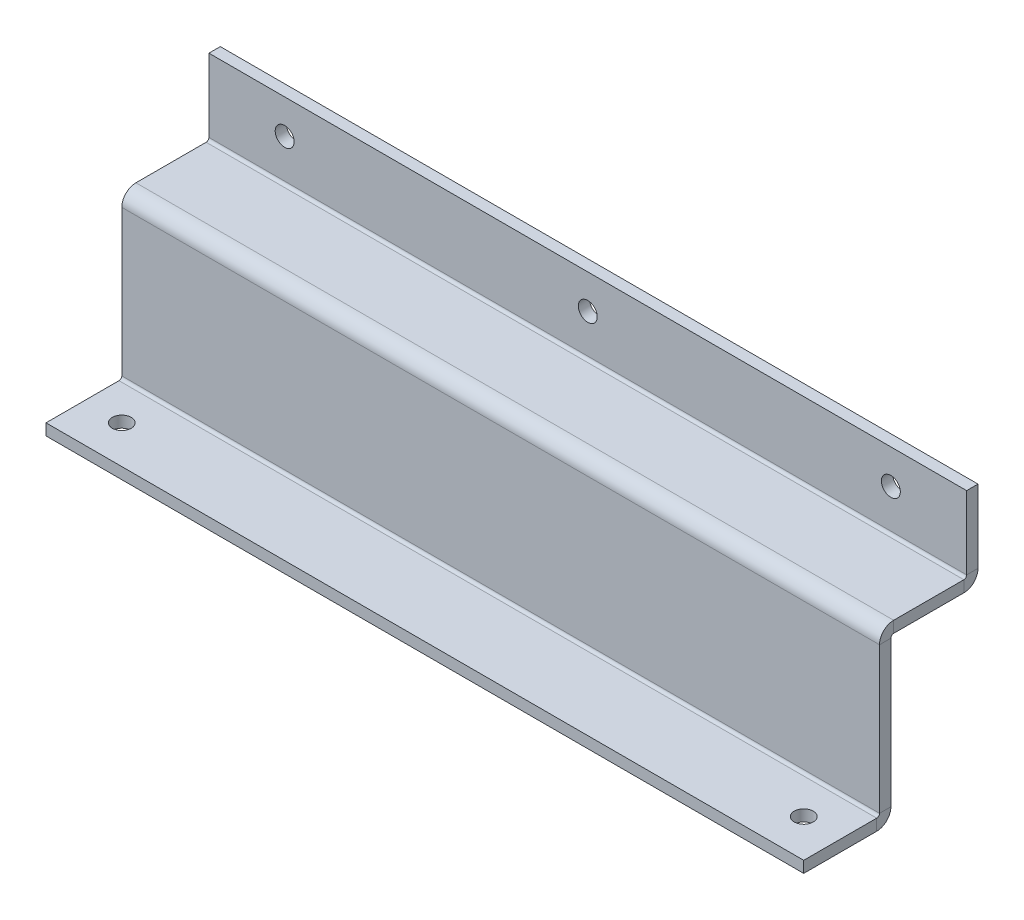
ISO-10303-21;
HEADER;
FILE_DESCRIPTION(('STEP AP214'),'2;1');
FILE_NAME('part.step','',(''),(''),'','','');
FILE_SCHEMA(('AUTOMOTIVE_DESIGN { 1 0 10303 214 1 1 1 1 }'));
ENDSEC;
DATA;
#1=APPLICATION_CONTEXT('core data for automotive mechanical design processes');
#2=APPLICATION_PROTOCOL_DEFINITION('international standard','automotive_design',2000,#1);
#3=PRODUCT_CONTEXT('',#1,'mechanical');
#4=PRODUCT('Part','Part','',(#3));
#5=PRODUCT_RELATED_PRODUCT_CATEGORY('part','',(#4));
#6=PRODUCT_DEFINITION_FORMATION('','',#4);
#7=PRODUCT_DEFINITION_CONTEXT('part definition',#1,'design');
#8=PRODUCT_DEFINITION('design','',#6,#7);
#9=PRODUCT_DEFINITION_SHAPE('','',#8);
#10=(LENGTH_UNIT() NAMED_UNIT(*) SI_UNIT(.MILLI.,.METRE.));
#11=(NAMED_UNIT(*) PLANE_ANGLE_UNIT() SI_UNIT($,.RADIAN.));
#12=(NAMED_UNIT(*) SI_UNIT($,.STERADIAN.) SOLID_ANGLE_UNIT());
#13=UNCERTAINTY_MEASURE_WITH_UNIT(LENGTH_MEASURE(1.E-05),#10,'distance_accuracy_value','');
#14=(GEOMETRIC_REPRESENTATION_CONTEXT(3) GLOBAL_UNCERTAINTY_ASSIGNED_CONTEXT((#13)) GLOBAL_UNIT_ASSIGNED_CONTEXT((#10,
#11,#12)) REPRESENTATION_CONTEXT('',''));
#15=CARTESIAN_POINT('',(0.,0.,0.));
#16=DIRECTION('',(0.,0.,1.));
#17=DIRECTION('',(1.,0.,0.));
#18=AXIS2_PLACEMENT_3D('',#15,#16,#17);
#19=CARTESIAN_POINT('',(-100.,43.0000000000001,-33.));
#20=DIRECTION('',(-1.,0.,0.));
#21=DIRECTION('',(0.,0.,1.));
#22=AXIS2_PLACEMENT_3D('',#19,#20,#21);
#23=PLANE('',#22);
#24=DIRECTION('',(0.,0.,-1.));
#25=VECTOR('',#24,1.);
#26=CARTESIAN_POINT('',(-100.,43.0000000000001,-33.));
#27=LINE('',#26,#25);
#28=CARTESIAN_POINT('',(-100.,43.,-13.7366));
#29=VERTEX_POINT('',#28);
#30=CARTESIAN_POINT('',(-100.,43.0000000000001,-32.2634));
#31=VERTEX_POINT('',#30);
#32=EDGE_CURVE('E213',#29,#31,#27,.T.);
#33=ORIENTED_EDGE('',*,*,#32,.T.);
#34=DIRECTION('',(0.,-1.,0.));
#35=VECTOR('',#34,1.);
#36=CARTESIAN_POINT('',(-100.,43.0000000000001,-32.2634));
#37=LINE('',#36,#35);
#38=CARTESIAN_POINT('',(-100.,40.0000000000001,-32.2634));
#39=VERTEX_POINT('',#38);
#40=EDGE_CURVE('E189',#31,#39,#37,.T.);
#41=ORIENTED_EDGE('',*,*,#40,.T.);
#42=DIRECTION('',(0.,0.,-1.));
#43=VECTOR('',#42,1.);
#44=CARTESIAN_POINT('',(-100.,40.0000000000001,-33.));
#45=LINE('',#44,#43);
#46=CARTESIAN_POINT('',(-100.,40.,-13.7366));
#47=VERTEX_POINT('',#46);
#48=EDGE_CURVE('E212',#47,#39,#45,.T.);
#49=ORIENTED_EDGE('',*,*,#48,.F.);
#50=DIRECTION('',(0.,1.,0.));
#51=VECTOR('',#50,1.);
#52=CARTESIAN_POINT('',(-100.,40.,-13.7366));
#53=LINE('',#52,#51);
#54=EDGE_CURVE('E199',#47,#29,#53,.T.);
#55=ORIENTED_EDGE('',*,*,#54,.T.);
#56=EDGE_LOOP('',(#33,#41,#49,#55));
#57=FACE_BOUND('',#56,.T.);
#58=ADVANCED_FACE('F32',(#57),#23,.T.);
#59=CARTESIAN_POINT('',(100.,43.,-13.));
#60=DIRECTION('',(0.,1.,0.));
#61=DIRECTION('',(0.,0.,1.));
#62=AXIS2_PLACEMENT_3D('',#59,#60,#61);
#63=PLANE('',#62);
#64=DIRECTION('',(0.,0.,1.));
#65=VECTOR('',#64,1.);
#66=CARTESIAN_POINT('',(100.,43.,-13.));
#67=LINE('',#66,#65);
#68=CARTESIAN_POINT('',(100.,43.0000000000001,-32.2634));
#69=VERTEX_POINT('',#68);
#70=CARTESIAN_POINT('',(100.,43.,-13.7366));
#71=VERTEX_POINT('',#70);
#72=EDGE_CURVE('E215',#69,#71,#67,.T.);
#73=ORIENTED_EDGE('',*,*,#72,.F.);
#74=DIRECTION('',(-1.,0.,0.));
#75=VECTOR('',#74,1.);
#76=CARTESIAN_POINT('',(-100.,43.0000000000001,-32.2634));
#77=LINE('',#76,#75);
#78=EDGE_CURVE('E54',#31,#69,#77,.F.);
#79=ORIENTED_EDGE('',*,*,#78,.F.);
#80=ORIENTED_EDGE('',*,*,#32,.F.);
#81=DIRECTION('',(1.,0.,0.));
#82=VECTOR('',#81,1.);
#83=CARTESIAN_POINT('',(100.,43.,-13.7366));
#84=LINE('',#83,#82);
#85=EDGE_CURVE('E207',#29,#71,#84,.T.);
#86=ORIENTED_EDGE('',*,*,#85,.T.);
#87=EDGE_LOOP('',(#73,#79,#80,#86));
#88=FACE_BOUND('',#87,.T.);
#89=ADVANCED_FACE('F336',(#88),#63,.T.);
#90=CARTESIAN_POINT('',(100.,40.,-13.));
#91=DIRECTION('',(0.,1.,0.));
#92=DIRECTION('',(0.,0.,1.));
#93=AXIS2_PLACEMENT_3D('',#90,#91,#92);
#94=PLANE('',#93);
#95=DIRECTION('',(-1.,0.,0.));
#96=VECTOR('',#95,1.);
#97=CARTESIAN_POINT('',(-100.,40.0000000000001,-32.2634));
#98=LINE('',#97,#96);
#99=CARTESIAN_POINT('',(100.,40.0000000000001,-32.2634));
#100=VERTEX_POINT('',#99);
#101=EDGE_CURVE('E183',#39,#100,#98,.F.);
#102=ORIENTED_EDGE('',*,*,#101,.T.);
#103=DIRECTION('',(0.,0.,1.));
#104=VECTOR('',#103,1.);
#105=CARTESIAN_POINT('',(100.,40.,-13.));
#106=LINE('',#105,#104);
#107=CARTESIAN_POINT('',(100.,40.,-13.7366));
#108=VERTEX_POINT('',#107);
#109=EDGE_CURVE('E216',#100,#108,#106,.T.);
#110=ORIENTED_EDGE('',*,*,#109,.T.);
#111=DIRECTION('',(1.,0.,0.));
#112=VECTOR('',#111,1.);
#113=CARTESIAN_POINT('',(-100.,40.,-13.7366));
#114=LINE('',#113,#112);
#115=EDGE_CURVE('E201',#47,#108,#114,.T.);
#116=ORIENTED_EDGE('',*,*,#115,.F.);
#117=ORIENTED_EDGE('',*,*,#48,.T.);
#118=EDGE_LOOP('',(#102,#110,#116,#117));
#119=FACE_BOUND('',#118,.T.);
#120=ADVANCED_FACE('F444',(#119),#94,.F.);
#121=CARTESIAN_POINT('',(100.,40.,-13.));
#122=DIRECTION('',(1.,0.,0.));
#123=DIRECTION('',(0.,0.,-1.));
#124=AXIS2_PLACEMENT_3D('',#121,#122,#123);
#125=PLANE('',#124);
#126=DIRECTION('',(0.,1.,0.));
#127=VECTOR('',#126,1.);
#128=CARTESIAN_POINT('',(100.,40.,-13.));
#129=LINE('',#128,#127);
#130=CARTESIAN_POINT('',(100.,0.736599999999985,-13.));
#131=VERTEX_POINT('',#130);
#132=CARTESIAN_POINT('',(100.,39.2634,-13.));
#133=VERTEX_POINT('',#132);
#134=EDGE_CURVE('E256',#131,#133,#129,.T.);
#135=ORIENTED_EDGE('',*,*,#134,.T.);
#136=DIRECTION('',(0.,0.,1.));
#137=VECTOR('',#136,1.);
#138=CARTESIAN_POINT('',(100.,39.2634,-13.));
#139=LINE('',#138,#137);
#140=CARTESIAN_POINT('',(100.,39.2634,-9.99999999999999));
#141=VERTEX_POINT('',#140);
#142=EDGE_CURVE('E228',#133,#141,#139,.T.);
#143=ORIENTED_EDGE('',*,*,#142,.T.);
#144=DIRECTION('',(0.,1.,0.));
#145=VECTOR('',#144,1.);
#146=CARTESIAN_POINT('',(100.,40.,-10.));
#147=LINE('',#146,#145);
#148=CARTESIAN_POINT('',(100.,0.736599999999985,-10.));
#149=VERTEX_POINT('',#148);
#150=EDGE_CURVE('E255',#149,#141,#147,.T.);
#151=ORIENTED_EDGE('',*,*,#150,.F.);
#152=DIRECTION('',(0.,0.,-1.));
#153=VECTOR('',#152,1.);
#154=CARTESIAN_POINT('',(100.,0.736599999999997,-10.));
#155=LINE('',#154,#153);
#156=EDGE_CURVE('E242',#149,#131,#155,.T.);
#157=ORIENTED_EDGE('',*,*,#156,.T.);
#158=EDGE_LOOP('',(#135,#143,#151,#157));
#159=FACE_BOUND('',#158,.T.);
#160=ADVANCED_FACE('F320',(#159),#125,.T.);
#161=CARTESIAN_POINT('',(-100.,0.,-13.));
#162=DIRECTION('',(0.,0.,-1.));
#163=DIRECTION('',(-1.,0.,0.));
#164=AXIS2_PLACEMENT_3D('',#161,#162,#163);
#165=PLANE('',#164);
#166=DIRECTION('',(0.,-1.,0.));
#167=VECTOR('',#166,1.);
#168=CARTESIAN_POINT('',(-100.,0.,-13.));
#169=LINE('',#168,#167);
#170=CARTESIAN_POINT('',(-100.,39.2634,-13.));
#171=VERTEX_POINT('',#170);
#172=CARTESIAN_POINT('',(-100.,0.736600000000019,-13.));
#173=VERTEX_POINT('',#172);
#174=EDGE_CURVE('E259',#171,#173,#169,.T.);
#175=ORIENTED_EDGE('',*,*,#174,.F.);
#176=DIRECTION('',(1.,0.,0.));
#177=VECTOR('',#176,1.);
#178=CARTESIAN_POINT('',(100.,39.2634,-13.));
#179=LINE('',#178,#177);
#180=EDGE_CURVE('E234',#133,#171,#179,.F.);
#181=ORIENTED_EDGE('',*,*,#180,.F.);
#182=ORIENTED_EDGE('',*,*,#134,.F.);
#183=DIRECTION('',(-1.,0.,0.));
#184=VECTOR('',#183,1.);
#185=CARTESIAN_POINT('',(-100.,0.73660000000002,-13.));
#186=LINE('',#185,#184);
#187=EDGE_CURVE('E250',#131,#173,#186,.T.);
#188=ORIENTED_EDGE('',*,*,#187,.T.);
#189=EDGE_LOOP('',(#175,#181,#182,#188));
#190=FACE_BOUND('',#189,.T.);
#191=ADVANCED_FACE('F324',(#190),#165,.T.);
#192=CARTESIAN_POINT('',(-100.,0.,-10.));
#193=DIRECTION('',(0.,0.,-1.));
#194=DIRECTION('',(-1.,0.,0.));
#195=AXIS2_PLACEMENT_3D('',#192,#193,#194);
#196=PLANE('',#195);
#197=DIRECTION('',(1.,0.,0.));
#198=VECTOR('',#197,1.);
#199=CARTESIAN_POINT('',(100.,39.2634,-9.99999999999999));
#200=LINE('',#199,#198);
#201=CARTESIAN_POINT('',(-100.,39.2634,-10.));
#202=VERTEX_POINT('',#201);
#203=EDGE_CURVE('E222',#141,#202,#200,.F.);
#204=ORIENTED_EDGE('',*,*,#203,.T.);
#205=DIRECTION('',(0.,-1.,0.));
#206=VECTOR('',#205,1.);
#207=CARTESIAN_POINT('',(-100.,0.,-10.));
#208=LINE('',#207,#206);
#209=CARTESIAN_POINT('',(-100.,0.7366,-10.));
#210=VERTEX_POINT('',#209);
#211=EDGE_CURVE('E260',#202,#210,#208,.T.);
#212=ORIENTED_EDGE('',*,*,#211,.T.);
#213=DIRECTION('',(-1.,0.,0.));
#214=VECTOR('',#213,1.);
#215=CARTESIAN_POINT('',(100.,0.736599999999997,-10.));
#216=LINE('',#215,#214);
#217=EDGE_CURVE('E244',#149,#210,#216,.T.);
#218=ORIENTED_EDGE('',*,*,#217,.F.);
#219=ORIENTED_EDGE('',*,*,#150,.T.);
#220=EDGE_LOOP('',(#204,#212,#218,#219));
#221=FACE_BOUND('',#220,.T.);
#222=ADVANCED_FACE('F459',(#221),#196,.F.);
#223=CARTESIAN_POINT('',(-100.,-3.,-10.));
#224=DIRECTION('',(-1.,0.,0.));
#225=DIRECTION('',(0.,0.,1.));
#226=AXIS2_PLACEMENT_3D('',#223,#224,#225);
#227=PLANE('',#226);
#228=DIRECTION('',(0.,0.,1.));
#229=VECTOR('',#228,1.);
#230=CARTESIAN_POINT('',(-100.,0.,-10.));
#231=LINE('',#230,#229);
#232=CARTESIAN_POINT('',(-100.,0.,-9.2634));
#233=VERTEX_POINT('',#232);
#234=CARTESIAN_POINT('',(-100.,0.,10.));
#235=VERTEX_POINT('',#234);
#236=EDGE_CURVE('E286',#233,#235,#231,.T.);
#237=ORIENTED_EDGE('',*,*,#236,.F.);
#238=DIRECTION('',(0.,-1.,0.));
#239=VECTOR('',#238,1.);
#240=CARTESIAN_POINT('',(-100.,0.,-9.2634));
#241=LINE('',#240,#239);
#242=CARTESIAN_POINT('',(-100.,-3.,-9.2634));
#243=VERTEX_POINT('',#242);
#244=EDGE_CURVE('E272',#233,#243,#241,.T.);
#245=ORIENTED_EDGE('',*,*,#244,.T.);
#246=DIRECTION('',(0.,0.,1.));
#247=VECTOR('',#246,1.);
#248=CARTESIAN_POINT('',(-100.,-3.,-10.));
#249=LINE('',#248,#247);
#250=CARTESIAN_POINT('',(-100.,-3.,10.));
#251=VERTEX_POINT('',#250);
#252=EDGE_CURVE('E289',#243,#251,#249,.T.);
#253=ORIENTED_EDGE('',*,*,#252,.T.);
#254=DIRECTION('',(0.,1.,0.));
#255=VECTOR('',#254,1.);
#256=CARTESIAN_POINT('',(-100.,-3.,10.));
#257=LINE('',#256,#255);
#258=EDGE_CURVE('E36',#251,#235,#257,.T.);
#259=ORIENTED_EDGE('',*,*,#258,.T.);
#260=EDGE_LOOP('',(#237,#245,#253,#259));
#261=FACE_BOUND('',#260,.T.);
#262=ADVANCED_FACE('F34',(#261),#227,.T.);
#263=CARTESIAN_POINT('',(-100.,-3.,10.));
#264=DIRECTION('',(0.,1.,0.));
#265=DIRECTION('',(0.,0.,1.));
#266=AXIS2_PLACEMENT_3D('',#263,#264,#265);
#267=PLANE('',#266);
#268=CARTESIAN_POINT('',(-90.,-3.,0.));
#269=DIRECTION('',(0.,1.,0.));
#270=DIRECTION('',(0.,0.,1.));
#271=AXIS2_PLACEMENT_3D('',#268,#269,#270);
#272=CIRCLE('',#271,2.49999999999999);
#273=CARTESIAN_POINT('',(-90.,-3.,2.49999999999999));
#274=VERTEX_POINT('',#273);
#275=EDGE_CURVE('E384',#274,#274,#272,.T.);
#276=ORIENTED_EDGE('',*,*,#275,.T.);
#277=EDGE_LOOP('',(#276));
#278=FACE_BOUND('',#277,.T.);
#279=CARTESIAN_POINT('',(90.,-3.,0.));
#280=DIRECTION('',(0.,1.,0.));
#281=DIRECTION('',(0.,0.,1.));
#282=AXIS2_PLACEMENT_3D('',#279,#280,#281);
#283=CIRCLE('',#282,2.49999999999999);
#284=CARTESIAN_POINT('',(90.,-3.,2.49999999999999));
#285=VERTEX_POINT('',#284);
#286=EDGE_CURVE('E378',#285,#285,#283,.T.);
#287=ORIENTED_EDGE('',*,*,#286,.T.);
#288=EDGE_LOOP('',(#287));
#289=FACE_BOUND('',#288,.T.);
#290=DIRECTION('',(-1.,0.,0.));
#291=VECTOR('',#290,1.);
#292=CARTESIAN_POINT('',(-100.,-3.,-9.2634));
#293=LINE('',#292,#291);
#294=CARTESIAN_POINT('',(100.,-3.,-9.2634));
#295=VERTEX_POINT('',#294);
#296=EDGE_CURVE('E266',#243,#295,#293,.F.);
#297=ORIENTED_EDGE('',*,*,#296,.T.);
#298=DIRECTION('',(0.,0.,-1.));
#299=VECTOR('',#298,1.);
#300=CARTESIAN_POINT('',(100.,-3.,-10.));
#301=LINE('',#300,#299);
#302=CARTESIAN_POINT('',(100.,-3.,10.));
#303=VERTEX_POINT('',#302);
#304=EDGE_CURVE('E295',#303,#295,#301,.T.);
#305=ORIENTED_EDGE('',*,*,#304,.F.);
#306=DIRECTION('',(1.,0.,0.));
#307=VECTOR('',#306,1.);
#308=CARTESIAN_POINT('',(-100.,-3.,10.));
#309=LINE('',#308,#307);
#310=EDGE_CURVE('E291',#251,#303,#309,.T.);
#311=ORIENTED_EDGE('',*,*,#310,.F.);
#312=ORIENTED_EDGE('',*,*,#252,.F.);
#313=EDGE_LOOP('',(#297,#305,#311,#312));
#314=FACE_BOUND('',#313,.T.);
#315=ADVANCED_FACE('F397',(#278,#289,#314),#267,.F.);
#316=CARTESIAN_POINT('',(-100.,0.,10.));
#317=DIRECTION('',(0.,1.,0.));
#318=DIRECTION('',(0.,0.,1.));
#319=AXIS2_PLACEMENT_3D('',#316,#317,#318);
#320=PLANE('',#319);
#321=CARTESIAN_POINT('',(-90.,0.,0.));
#322=DIRECTION('',(0.,1.,0.));
#323=DIRECTION('',(0.,0.,1.));
#324=AXIS2_PLACEMENT_3D('',#321,#322,#323);
#325=CIRCLE('',#324,2.49999999999999);
#326=CARTESIAN_POINT('',(-90.,0.,2.49999999999999));
#327=VERTEX_POINT('',#326);
#328=EDGE_CURVE('E387',#327,#327,#325,.T.);
#329=ORIENTED_EDGE('',*,*,#328,.F.);
#330=EDGE_LOOP('',(#329));
#331=FACE_BOUND('',#330,.T.);
#332=CARTESIAN_POINT('',(90.,0.,0.));
#333=DIRECTION('',(0.,1.,0.));
#334=DIRECTION('',(0.,0.,1.));
#335=AXIS2_PLACEMENT_3D('',#332,#333,#334);
#336=CIRCLE('',#335,2.49999999999999);
#337=CARTESIAN_POINT('',(90.,0.,2.49999999999999));
#338=VERTEX_POINT('',#337);
#339=EDGE_CURVE('E381',#338,#338,#336,.T.);
#340=ORIENTED_EDGE('',*,*,#339,.F.);
#341=EDGE_LOOP('',(#340));
#342=FACE_BOUND('',#341,.T.);
#343=DIRECTION('',(0.,0.,-1.));
#344=VECTOR('',#343,1.);
#345=CARTESIAN_POINT('',(100.,0.,-10.));
#346=LINE('',#345,#344);
#347=CARTESIAN_POINT('',(100.,0.,10.));
#348=VERTEX_POINT('',#347);
#349=CARTESIAN_POINT('',(100.,0.,-9.2634));
#350=VERTEX_POINT('',#349);
#351=EDGE_CURVE('E292',#348,#350,#346,.T.);
#352=ORIENTED_EDGE('',*,*,#351,.T.);
#353=DIRECTION('',(-1.,0.,0.));
#354=VECTOR('',#353,1.);
#355=CARTESIAN_POINT('',(-100.,0.,-9.2634));
#356=LINE('',#355,#354);
#357=EDGE_CURVE('E278',#233,#350,#356,.F.);
#358=ORIENTED_EDGE('',*,*,#357,.F.);
#359=ORIENTED_EDGE('',*,*,#236,.T.);
#360=DIRECTION('',(1.,0.,0.));
#361=VECTOR('',#360,1.);
#362=CARTESIAN_POINT('',(-100.,0.,10.));
#363=LINE('',#362,#361);
#364=EDGE_CURVE('E299',#235,#348,#363,.T.);
#365=ORIENTED_EDGE('',*,*,#364,.T.);
#366=EDGE_LOOP('',(#352,#358,#359,#365));
#367=FACE_BOUND('',#366,.T.);
#368=ADVANCED_FACE('F305',(#331,#342,#367),#320,.T.);
#369=CARTESIAN_POINT('',(100.,-3.,-10.));
#370=DIRECTION('',(1.,0.,0.));
#371=DIRECTION('',(0.,0.,-1.));
#372=AXIS2_PLACEMENT_3D('',#369,#370,#371);
#373=PLANE('',#372);
#374=DIRECTION('',(0.,-1.,0.));
#375=VECTOR('',#374,1.);
#376=CARTESIAN_POINT('',(100.,0.,-9.2634));
#377=LINE('',#376,#375);
#378=EDGE_CURVE('E283',#350,#295,#377,.T.);
#379=ORIENTED_EDGE('',*,*,#378,.F.);
#380=ORIENTED_EDGE('',*,*,#351,.F.);
#381=DIRECTION('',(0.,1.,0.));
#382=VECTOR('',#381,1.);
#383=CARTESIAN_POINT('',(100.,-3.,10.));
#384=LINE('',#383,#382);
#385=EDGE_CURVE('E11',#303,#348,#384,.T.);
#386=ORIENTED_EDGE('',*,*,#385,.F.);
#387=ORIENTED_EDGE('',*,*,#304,.T.);
#388=EDGE_LOOP('',(#379,#380,#386,#387));
#389=FACE_BOUND('',#388,.T.);
#390=ADVANCED_FACE('F396',(#389),#373,.T.);
#391=CARTESIAN_POINT('',(-100.,-3.,10.));
#392=DIRECTION('',(0.,0.,1.));
#393=DIRECTION('',(1.,0.,0.));
#394=AXIS2_PLACEMENT_3D('',#391,#392,#393);
#395=PLANE('',#394);
#396=ORIENTED_EDGE('',*,*,#364,.F.);
#397=ORIENTED_EDGE('',*,*,#258,.F.);
#398=ORIENTED_EDGE('',*,*,#310,.T.);
#399=ORIENTED_EDGE('',*,*,#385,.T.);
#400=EDGE_LOOP('',(#396,#397,#398,#399));
#401=FACE_BOUND('',#400,.T.);
#402=ADVANCED_FACE('F418',(#401),#395,.T.);
#403=CARTESIAN_POINT('',(100.,0.736599999999985,-9.2634));
#404=DIRECTION('',(1.,0.,0.));
#405=DIRECTION('',(0.,1.,0.));
#406=AXIS2_PLACEMENT_3D('',#403,#404,#405);
#407=PLANE('',#406);
#408=ORIENTED_EDGE('',*,*,#156,.F.);
#409=CARTESIAN_POINT('',(100.,0.736599999999985,-9.2634));
#410=DIRECTION('',(-1.,0.,0.));
#411=DIRECTION('',(0.,-1.,0.));
#412=AXIS2_PLACEMENT_3D('',#409,#410,#411);
#413=CIRCLE('',#412,0.7366);
#414=EDGE_CURVE('E275',#350,#149,#413,.F.);
#415=ORIENTED_EDGE('',*,*,#414,.F.);
#416=ORIENTED_EDGE('',*,*,#378,.T.);
#417=CARTESIAN_POINT('',(100.,0.736599999999985,-9.2634));
#418=DIRECTION('',(-1.,0.,0.));
#419=DIRECTION('',(0.,-1.,0.));
#420=AXIS2_PLACEMENT_3D('',#417,#418,#419);
#421=CIRCLE('',#420,3.7366);
#422=EDGE_CURVE('E268',#295,#131,#421,.F.);
#423=ORIENTED_EDGE('',*,*,#422,.T.);
#424=EDGE_LOOP('',(#408,#415,#416,#423));
#425=FACE_BOUND('',#424,.T.);
#426=ADVANCED_FACE('F315',(#425),#407,.T.);
#427=CARTESIAN_POINT('',(-100.,0.7366,-9.2634));
#428=DIRECTION('',(1.,0.,0.));
#429=DIRECTION('',(0.,1.,0.));
#430=AXIS2_PLACEMENT_3D('',#427,#428,#429);
#431=PLANE('',#430);
#432=CARTESIAN_POINT('',(-100.,0.7366,-9.2634));
#433=DIRECTION('',(-1.,0.,0.));
#434=DIRECTION('',(0.,-1.,0.));
#435=AXIS2_PLACEMENT_3D('',#432,#433,#434);
#436=CIRCLE('',#435,0.7366);
#437=EDGE_CURVE('E262',#210,#233,#436,.T.);
#438=ORIENTED_EDGE('',*,*,#437,.F.);
#439=DIRECTION('',(0.,0.,-1.));
#440=VECTOR('',#439,1.);
#441=CARTESIAN_POINT('',(-100.,0.736599999999999,-10.));
#442=LINE('',#441,#440);
#443=EDGE_CURVE('E247',#210,#173,#442,.T.);
#444=ORIENTED_EDGE('',*,*,#443,.T.);
#445=CARTESIAN_POINT('',(-100.,0.7366,-9.2634));
#446=DIRECTION('',(-1.,0.,0.));
#447=DIRECTION('',(0.,-1.,0.));
#448=AXIS2_PLACEMENT_3D('',#445,#446,#447);
#449=CIRCLE('',#448,3.7366);
#450=EDGE_CURVE('E269',#173,#243,#449,.T.);
#451=ORIENTED_EDGE('',*,*,#450,.T.);
#452=ORIENTED_EDGE('',*,*,#244,.F.);
#453=EDGE_LOOP('',(#438,#444,#451,#452));
#454=FACE_BOUND('',#453,.T.);
#455=ADVANCED_FACE('F424',(#454),#431,.F.);
#456=CARTESIAN_POINT('',(-100.,0.7366,-9.2634));
#457=DIRECTION('',(-1.,0.,0.));
#458=DIRECTION('',(0.,0.,-1.));
#459=AXIS2_PLACEMENT_3D('',#456,#457,#458);
#460=CYLINDRICAL_SURFACE('',#459,3.7366);
#461=ORIENTED_EDGE('',*,*,#296,.F.);
#462=ORIENTED_EDGE('',*,*,#450,.F.);
#463=ORIENTED_EDGE('',*,*,#187,.F.);
#464=ORIENTED_EDGE('',*,*,#422,.F.);
#465=EDGE_LOOP('',(#461,#462,#463,#464));
#466=FACE_BOUND('',#465,.T.);
#467=ADVANCED_FACE('F426',(#466),#460,.T.);
#468=CARTESIAN_POINT('',(-100.,0.7366,-9.2634));
#469=DIRECTION('',(-1.,0.,0.));
#470=DIRECTION('',(0.,0.,-1.));
#471=AXIS2_PLACEMENT_3D('',#468,#469,#470);
#472=CYLINDRICAL_SURFACE('',#471,0.7366);
#473=ORIENTED_EDGE('',*,*,#357,.T.);
#474=ORIENTED_EDGE('',*,*,#414,.T.);
#475=ORIENTED_EDGE('',*,*,#217,.T.);
#476=ORIENTED_EDGE('',*,*,#437,.T.);
#477=EDGE_LOOP('',(#473,#474,#475,#476));
#478=FACE_BOUND('',#477,.T.);
#479=ADVANCED_FACE('F311',(#478),#472,.F.);
#480=CARTESIAN_POINT('',(-100.,0.,-13.));
#481=DIRECTION('',(-1.,0.,0.));
#482=DIRECTION('',(0.,0.,1.));
#483=AXIS2_PLACEMENT_3D('',#480,#481,#482);
#484=PLANE('',#483);
#485=DIRECTION('',(0.,0.,1.));
#486=VECTOR('',#485,1.);
#487=CARTESIAN_POINT('',(-100.,39.2634,-13.));
#488=LINE('',#487,#486);
#489=EDGE_CURVE('E239',#171,#202,#488,.T.);
#490=ORIENTED_EDGE('',*,*,#489,.F.);
#491=ORIENTED_EDGE('',*,*,#174,.T.);
#492=ORIENTED_EDGE('',*,*,#443,.F.);
#493=ORIENTED_EDGE('',*,*,#211,.F.);
#494=EDGE_LOOP('',(#490,#491,#492,#493));
#495=FACE_BOUND('',#494,.T.);
#496=ADVANCED_FACE('F433',(#495),#484,.T.);
#497=CARTESIAN_POINT('',(-100.,39.2634,-13.7366));
#498=DIRECTION('',(-1.,0.,0.));
#499=DIRECTION('',(0.,0.,1.));
#500=AXIS2_PLACEMENT_3D('',#497,#498,#499);
#501=PLANE('',#500);
#502=ORIENTED_EDGE('',*,*,#54,.F.);
#503=CARTESIAN_POINT('',(-100.,39.2634,-13.7366));
#504=DIRECTION('',(1.,0.,0.));
#505=DIRECTION('',(0.,0.,-1.));
#506=AXIS2_PLACEMENT_3D('',#503,#504,#505);
#507=CIRCLE('',#506,0.736599999999997);
#508=EDGE_CURVE('E231',#171,#47,#507,.F.);
#509=ORIENTED_EDGE('',*,*,#508,.F.);
#510=ORIENTED_EDGE('',*,*,#489,.T.);
#511=CARTESIAN_POINT('',(-100.,39.2634,-13.7366));
#512=DIRECTION('',(1.,0.,0.));
#513=DIRECTION('',(0.,0.,-1.));
#514=AXIS2_PLACEMENT_3D('',#511,#512,#513);
#515=CIRCLE('',#514,3.7366);
#516=EDGE_CURVE('E224',#202,#29,#515,.F.);
#517=ORIENTED_EDGE('',*,*,#516,.T.);
#518=EDGE_LOOP('',(#502,#509,#510,#517));
#519=FACE_BOUND('',#518,.T.);
#520=ADVANCED_FACE('F331',(#519),#501,.T.);
#521=CARTESIAN_POINT('',(100.,39.2634,-13.7366));
#522=DIRECTION('',(-1.,0.,0.));
#523=DIRECTION('',(0.,0.,1.));
#524=AXIS2_PLACEMENT_3D('',#521,#522,#523);
#525=PLANE('',#524);
#526=CARTESIAN_POINT('',(100.,39.2634,-13.7366));
#527=DIRECTION('',(1.,0.,0.));
#528=DIRECTION('',(0.,0.,-1.));
#529=AXIS2_PLACEMENT_3D('',#526,#527,#528);
#530=CIRCLE('',#529,0.736599999999997);
#531=EDGE_CURVE('E218',#108,#133,#530,.T.);
#532=ORIENTED_EDGE('',*,*,#531,.F.);
#533=DIRECTION('',(0.,1.,0.));
#534=VECTOR('',#533,1.);
#535=CARTESIAN_POINT('',(100.,40.,-13.7366));
#536=LINE('',#535,#534);
#537=EDGE_CURVE('E204',#108,#71,#536,.T.);
#538=ORIENTED_EDGE('',*,*,#537,.T.);
#539=CARTESIAN_POINT('',(100.,39.2634,-13.7366));
#540=DIRECTION('',(1.,0.,0.));
#541=DIRECTION('',(0.,0.,-1.));
#542=AXIS2_PLACEMENT_3D('',#539,#540,#541);
#543=CIRCLE('',#542,3.7366);
#544=EDGE_CURVE('E225',#71,#141,#543,.T.);
#545=ORIENTED_EDGE('',*,*,#544,.T.);
#546=ORIENTED_EDGE('',*,*,#142,.F.);
#547=EDGE_LOOP('',(#532,#538,#545,#546));
#548=FACE_BOUND('',#547,.T.);
#549=ADVANCED_FACE('F343',(#548),#525,.F.);
#550=CARTESIAN_POINT('',(100.,39.2634,-13.7366));
#551=DIRECTION('',(1.,0.,0.));
#552=DIRECTION('',(0.,1.,0.));
#553=AXIS2_PLACEMENT_3D('',#550,#551,#552);
#554=CYLINDRICAL_SURFACE('',#553,3.7366);
#555=ORIENTED_EDGE('',*,*,#203,.F.);
#556=ORIENTED_EDGE('',*,*,#544,.F.);
#557=ORIENTED_EDGE('',*,*,#85,.F.);
#558=ORIENTED_EDGE('',*,*,#516,.F.);
#559=EDGE_LOOP('',(#555,#556,#557,#558));
#560=FACE_BOUND('',#559,.T.);
#561=ADVANCED_FACE('F340',(#560),#554,.T.);
#562=CARTESIAN_POINT('',(100.,39.2634,-13.7366));
#563=DIRECTION('',(1.,0.,0.));
#564=DIRECTION('',(0.,1.,0.));
#565=AXIS2_PLACEMENT_3D('',#562,#563,#564);
#566=CYLINDRICAL_SURFACE('',#565,0.736599999999997);
#567=ORIENTED_EDGE('',*,*,#180,.T.);
#568=ORIENTED_EDGE('',*,*,#508,.T.);
#569=ORIENTED_EDGE('',*,*,#115,.T.);
#570=ORIENTED_EDGE('',*,*,#531,.T.);
#571=EDGE_LOOP('',(#567,#568,#569,#570));
#572=FACE_BOUND('',#571,.T.);
#573=ADVANCED_FACE('F327',(#572),#566,.F.);
#574=CARTESIAN_POINT('',(100.,43.,-13.));
#575=DIRECTION('',(1.,0.,0.));
#576=DIRECTION('',(0.,0.,-1.));
#577=AXIS2_PLACEMENT_3D('',#574,#575,#576);
#578=PLANE('',#577);
#579=DIRECTION('',(0.,-1.,0.));
#580=VECTOR('',#579,1.);
#581=CARTESIAN_POINT('',(100.,43.0000000000001,-32.2634));
#582=LINE('',#581,#580);
#583=EDGE_CURVE('E47',#69,#100,#582,.T.);
#584=ORIENTED_EDGE('',*,*,#583,.F.);
#585=ORIENTED_EDGE('',*,*,#72,.T.);
#586=ORIENTED_EDGE('',*,*,#537,.F.);
#587=ORIENTED_EDGE('',*,*,#109,.F.);
#588=EDGE_LOOP('',(#584,#585,#586,#587));
#589=FACE_BOUND('',#588,.T.);
#590=ADVANCED_FACE('F344',(#589),#578,.T.);
#591=CARTESIAN_POINT('',(100.,43.7366000000001,-32.2634));
#592=DIRECTION('',(1.,0.,0.));
#593=DIRECTION('',(0.,0.,-1.));
#594=AXIS2_PLACEMENT_3D('',#591,#592,#593);
#595=PLANE('',#594);
#596=DIRECTION('',(0.,0.,-1.));
#597=VECTOR('',#596,1.);
#598=CARTESIAN_POINT('',(100.,43.7366000000001,-33.));
#599=LINE('',#598,#597);
#600=CARTESIAN_POINT('',(100.,43.7366000000001,-33.));
#601=VERTEX_POINT('',#600);
#602=CARTESIAN_POINT('',(100.,43.7366000000001,-36.));
#603=VERTEX_POINT('',#602);
#604=EDGE_CURVE('E153',#601,#603,#599,.T.);
#605=ORIENTED_EDGE('',*,*,#604,.F.);
#606=CARTESIAN_POINT('',(100.,43.7366000000001,-32.2634));
#607=DIRECTION('',(-1.,0.,0.));
#608=DIRECTION('',(0.,0.,1.));
#609=AXIS2_PLACEMENT_3D('',#606,#607,#608);
#610=CIRCLE('',#609,0.73659999999999);
#611=EDGE_CURVE('E192',#69,#601,#610,.F.);
#612=ORIENTED_EDGE('',*,*,#611,.F.);
#613=ORIENTED_EDGE('',*,*,#583,.T.);
#614=CARTESIAN_POINT('',(100.,43.7366000000001,-32.2634));
#615=DIRECTION('',(-1.,0.,0.));
#616=DIRECTION('',(0.,0.,1.));
#617=AXIS2_PLACEMENT_3D('',#614,#615,#616);
#618=CIRCLE('',#617,3.73659999999999);
#619=EDGE_CURVE('E185',#100,#603,#618,.F.);
#620=ORIENTED_EDGE('',*,*,#619,.T.);
#621=EDGE_LOOP('',(#605,#612,#613,#620));
#622=FACE_BOUND('',#621,.T.);
#623=ADVANCED_FACE('F349',(#622),#595,.T.);
#624=CARTESIAN_POINT('',(-100.,43.7366000000001,-32.2634));
#625=DIRECTION('',(1.,0.,0.));
#626=DIRECTION('',(0.,0.,-1.));
#627=AXIS2_PLACEMENT_3D('',#624,#625,#626);
#628=PLANE('',#627);
#629=CARTESIAN_POINT('',(-100.,43.7366000000001,-32.2634));
#630=DIRECTION('',(-1.,0.,0.));
#631=DIRECTION('',(0.,0.,1.));
#632=AXIS2_PLACEMENT_3D('',#629,#630,#631);
#633=CIRCLE('',#632,0.73659999999999);
#634=CARTESIAN_POINT('',(-100.,43.7366000000001,-33.));
#635=VERTEX_POINT('',#634);
#636=EDGE_CURVE('E181',#635,#31,#633,.T.);
#637=ORIENTED_EDGE('',*,*,#636,.F.);
#638=DIRECTION('',(0.,0.,-1.));
#639=VECTOR('',#638,1.);
#640=CARTESIAN_POINT('',(-100.,43.7366000000001,-33.));
#641=LINE('',#640,#639);
#642=CARTESIAN_POINT('',(-100.,43.7366000000001,-36.));
#643=VERTEX_POINT('',#642);
#644=EDGE_CURVE('E354',#635,#643,#641,.T.);
#645=ORIENTED_EDGE('',*,*,#644,.T.);
#646=CARTESIAN_POINT('',(-100.,43.7366000000001,-32.2634));
#647=DIRECTION('',(-1.,0.,0.));
#648=DIRECTION('',(0.,0.,1.));
#649=AXIS2_PLACEMENT_3D('',#646,#647,#648);
#650=CIRCLE('',#649,3.73659999999999);
#651=EDGE_CURVE('E186',#643,#39,#650,.T.);
#652=ORIENTED_EDGE('',*,*,#651,.T.);
#653=ORIENTED_EDGE('',*,*,#40,.F.);
#654=EDGE_LOOP('',(#637,#645,#652,#653));
#655=FACE_BOUND('',#654,.T.);
#656=ADVANCED_FACE('F472',(#655),#628,.F.);
#657=CARTESIAN_POINT('',(-100.,43.7366000000001,-32.2634));
#658=DIRECTION('',(-1.,0.,0.));
#659=DIRECTION('',(0.,0.,-1.));
#660=AXIS2_PLACEMENT_3D('',#657,#658,#659);
#661=CYLINDRICAL_SURFACE('',#660,3.73659999999999);
#662=ORIENTED_EDGE('',*,*,#101,.F.);
#663=ORIENTED_EDGE('',*,*,#651,.F.);
#664=DIRECTION('',(-1.,0.,0.));
#665=VECTOR('',#664,1.);
#666=CARTESIAN_POINT('',(-100.,43.7366000000001,-36.));
#667=LINE('',#666,#665);
#668=EDGE_CURVE('E177',#603,#643,#667,.T.);
#669=ORIENTED_EDGE('',*,*,#668,.F.);
#670=ORIENTED_EDGE('',*,*,#619,.F.);
#671=EDGE_LOOP('',(#662,#663,#669,#670));
#672=FACE_BOUND('',#671,.T.);
#673=ADVANCED_FACE('F352',(#672),#661,.T.);
#674=CARTESIAN_POINT('',(-100.,43.7366000000001,-32.2634));
#675=DIRECTION('',(-1.,0.,0.));
#676=DIRECTION('',(0.,0.,-1.));
#677=AXIS2_PLACEMENT_3D('',#674,#675,#676);
#678=CYLINDRICAL_SURFACE('',#677,0.73659999999999);
#679=ORIENTED_EDGE('',*,*,#78,.T.);
#680=ORIENTED_EDGE('',*,*,#611,.T.);
#681=DIRECTION('',(-1.,0.,0.));
#682=VECTOR('',#681,1.);
#683=CARTESIAN_POINT('',(100.,43.7366000000001,-33.));
#684=LINE('',#683,#682);
#685=EDGE_CURVE('E355',#601,#635,#684,.T.);
#686=ORIENTED_EDGE('',*,*,#685,.T.);
#687=ORIENTED_EDGE('',*,*,#636,.T.);
#688=EDGE_LOOP('',(#679,#680,#686,#687));
#689=FACE_BOUND('',#688,.T.);
#690=ADVANCED_FACE('F476',(#689),#678,.F.);
#691=CARTESIAN_POINT('',(-100.,43.0000000000001,-36.));
#692=DIRECTION('',(-1.,0.,0.));
#693=DIRECTION('',(0.,0.,1.));
#694=AXIS2_PLACEMENT_3D('',#691,#692,#693);
#695=PLANE('',#694);
#696=DIRECTION('',(0.,-1.,0.));
#697=VECTOR('',#696,1.);
#698=CARTESIAN_POINT('',(-100.,43.0000000000001,-36.));
#699=LINE('',#698,#697);
#700=CARTESIAN_POINT('',(-100.,63.0000000000001,-36.));
#701=VERTEX_POINT('',#700);
#702=EDGE_CURVE('E167',#701,#643,#699,.T.);
#703=ORIENTED_EDGE('',*,*,#702,.T.);
#704=ORIENTED_EDGE('',*,*,#644,.F.);
#705=DIRECTION('',(0.,-1.,0.));
#706=VECTOR('',#705,1.);
#707=CARTESIAN_POINT('',(-100.,43.0000000000001,-33.));
#708=LINE('',#707,#706);
#709=CARTESIAN_POINT('',(-100.,63.0000000000001,-33.));
#710=VERTEX_POINT('',#709);
#711=EDGE_CURVE('E158',#710,#635,#708,.T.);
#712=ORIENTED_EDGE('',*,*,#711,.F.);
#713=DIRECTION('',(0.,0.,1.));
#714=VECTOR('',#713,1.);
#715=CARTESIAN_POINT('',(-100.,63.0000000000001,-36.));
#716=LINE('',#715,#714);
#717=EDGE_CURVE('E166',#701,#710,#716,.T.);
#718=ORIENTED_EDGE('',*,*,#717,.F.);
#719=EDGE_LOOP('',(#703,#704,#712,#718));
#720=FACE_BOUND('',#719,.T.);
#721=ADVANCED_FACE('F481',(#720),#695,.T.);
#722=CARTESIAN_POINT('',(100.,63.0000000000001,-36.));
#723=DIRECTION('',(1.,0.,0.));
#724=DIRECTION('',(0.,0.,-1.));
#725=AXIS2_PLACEMENT_3D('',#722,#723,#724);
#726=PLANE('',#725);
#727=DIRECTION('',(0.,1.,0.));
#728=VECTOR('',#727,1.);
#729=CARTESIAN_POINT('',(100.,63.0000000000001,-33.));
#730=LINE('',#729,#728);
#731=CARTESIAN_POINT('',(100.,63.0000000000001,-33.));
#732=VERTEX_POINT('',#731);
#733=EDGE_CURVE('E175',#601,#732,#730,.T.);
#734=ORIENTED_EDGE('',*,*,#733,.F.);
#735=ORIENTED_EDGE('',*,*,#604,.T.);
#736=DIRECTION('',(0.,1.,0.));
#737=VECTOR('',#736,1.);
#738=CARTESIAN_POINT('',(100.,63.0000000000001,-36.));
#739=LINE('',#738,#737);
#740=CARTESIAN_POINT('',(100.,63.0000000000001,-36.));
#741=VERTEX_POINT('',#740);
#742=EDGE_CURVE('E147',#603,#741,#739,.T.);
#743=ORIENTED_EDGE('',*,*,#742,.T.);
#744=DIRECTION('',(0.,0.,1.));
#745=VECTOR('',#744,1.);
#746=CARTESIAN_POINT('',(100.,63.0000000000001,-36.));
#747=LINE('',#746,#745);
#748=EDGE_CURVE('E151',#741,#732,#747,.T.);
#749=ORIENTED_EDGE('',*,*,#748,.T.);
#750=EDGE_LOOP('',(#734,#735,#743,#749));
#751=FACE_BOUND('',#750,.T.);
#752=ADVANCED_FACE('F150',(#751),#726,.T.);
#753=CARTESIAN_POINT('',(-100.,43.0000000000001,-36.));
#754=DIRECTION('',(0.,0.,-1.));
#755=DIRECTION('',(-1.,0.,0.));
#756=AXIS2_PLACEMENT_3D('',#753,#754,#755);
#757=PLANE('',#756);
#758=CARTESIAN_POINT('',(-80.,53.9718596444629,-36.));
#759=DIRECTION('',(0.,0.,-1.));
#760=DIRECTION('',(-1.,0.,0.));
#761=AXIS2_PLACEMENT_3D('',#758,#759,#760);
#762=CIRCLE('',#761,2.49999999999999);
#763=CARTESIAN_POINT('',(-82.5,53.9718596444629,-36.));
#764=VERTEX_POINT('',#763);
#765=EDGE_CURVE('E372',#764,#764,#762,.T.);
#766=ORIENTED_EDGE('',*,*,#765,.F.);
#767=EDGE_LOOP('',(#766));
#768=FACE_BOUND('',#767,.T.);
#769=CARTESIAN_POINT('',(80.,53.9718596444629,-36.));
#770=DIRECTION('',(0.,0.,-1.));
#771=DIRECTION('',(-1.,0.,0.));
#772=AXIS2_PLACEMENT_3D('',#769,#770,#771);
#773=CIRCLE('',#772,2.49999999999999);
#774=CARTESIAN_POINT('',(77.5,53.9718596444629,-36.));
#775=VERTEX_POINT('',#774);
#776=EDGE_CURVE('E366',#775,#775,#773,.T.);
#777=ORIENTED_EDGE('',*,*,#776,.F.);
#778=EDGE_LOOP('',(#777));
#779=FACE_BOUND('',#778,.T.);
#780=CARTESIAN_POINT('',(0.,53.9718596444629,-36.));
#781=DIRECTION('',(0.,0.,-1.));
#782=DIRECTION('',(-1.,0.,0.));
#783=AXIS2_PLACEMENT_3D('',#780,#781,#782);
#784=CIRCLE('',#783,2.49999999999999);
#785=CARTESIAN_POINT('',(-2.49999999999999,53.9718596444629,-36.));
#786=VERTEX_POINT('',#785);
#787=EDGE_CURVE('E358',#786,#786,#784,.T.);
#788=ORIENTED_EDGE('',*,*,#787,.F.);
#789=EDGE_LOOP('',(#788));
#790=FACE_BOUND('',#789,.T.);
#791=ORIENTED_EDGE('',*,*,#742,.F.);
#792=ORIENTED_EDGE('',*,*,#668,.T.);
#793=ORIENTED_EDGE('',*,*,#702,.F.);
#794=DIRECTION('',(-1.,0.,0.));
#795=VECTOR('',#794,1.);
#796=CARTESIAN_POINT('',(-100.,63.0000000000001,-36.));
#797=LINE('',#796,#795);
#798=EDGE_CURVE('E157',#741,#701,#797,.T.);
#799=ORIENTED_EDGE('',*,*,#798,.F.);
#800=EDGE_LOOP('',(#791,#792,#793,#799));
#801=FACE_BOUND('',#800,.T.);
#802=ADVANCED_FACE('F169',(#768,#779,#790,#801),#757,.T.);
#803=CARTESIAN_POINT('',(-100.,43.0000000000001,-33.));
#804=DIRECTION('',(0.,0.,-1.));
#805=DIRECTION('',(-1.,0.,0.));
#806=AXIS2_PLACEMENT_3D('',#803,#804,#805);
#807=PLANE('',#806);
#808=CARTESIAN_POINT('',(-80.,53.9718596444629,-33.));
#809=DIRECTION('',(0.,0.,1.));
#810=DIRECTION('',(1.,0.,0.));
#811=AXIS2_PLACEMENT_3D('',#808,#809,#810);
#812=CIRCLE('',#811,2.49999999999999);
#813=CARTESIAN_POINT('',(-77.5,53.9718596444629,-33.));
#814=VERTEX_POINT('',#813);
#815=EDGE_CURVE('E375',#814,#814,#812,.T.);
#816=ORIENTED_EDGE('',*,*,#815,.F.);
#817=EDGE_LOOP('',(#816));
#818=FACE_BOUND('',#817,.T.);
#819=CARTESIAN_POINT('',(80.,53.9718596444629,-33.));
#820=DIRECTION('',(0.,0.,1.));
#821=DIRECTION('',(1.,0.,0.));
#822=AXIS2_PLACEMENT_3D('',#819,#820,#821);
#823=CIRCLE('',#822,2.49999999999999);
#824=CARTESIAN_POINT('',(82.5,53.9718596444629,-33.));
#825=VERTEX_POINT('',#824);
#826=EDGE_CURVE('E369',#825,#825,#823,.T.);
#827=ORIENTED_EDGE('',*,*,#826,.F.);
#828=EDGE_LOOP('',(#827));
#829=FACE_BOUND('',#828,.T.);
#830=CARTESIAN_POINT('',(0.,53.9718596444629,-33.));
#831=DIRECTION('',(0.,0.,1.));
#832=DIRECTION('',(1.,0.,0.));
#833=AXIS2_PLACEMENT_3D('',#830,#831,#832);
#834=CIRCLE('',#833,2.49999999999999);
#835=CARTESIAN_POINT('',(2.49999999999999,53.9718596444629,-33.));
#836=VERTEX_POINT('',#835);
#837=EDGE_CURVE('E363',#836,#836,#834,.T.);
#838=ORIENTED_EDGE('',*,*,#837,.F.);
#839=EDGE_LOOP('',(#838));
#840=FACE_BOUND('',#839,.T.);
#841=ORIENTED_EDGE('',*,*,#685,.F.);
#842=ORIENTED_EDGE('',*,*,#733,.T.);
#843=DIRECTION('',(-1.,0.,0.));
#844=VECTOR('',#843,1.);
#845=CARTESIAN_POINT('',(-100.,63.0000000000001,-33.));
#846=LINE('',#845,#844);
#847=EDGE_CURVE('E165',#732,#710,#846,.T.);
#848=ORIENTED_EDGE('',*,*,#847,.T.);
#849=ORIENTED_EDGE('',*,*,#711,.T.);
#850=EDGE_LOOP('',(#841,#842,#848,#849));
#851=FACE_BOUND('',#850,.T.);
#852=ADVANCED_FACE('F490',(#818,#829,#840,#851),#807,.F.);
#853=CARTESIAN_POINT('',(-100.,63.0000000000001,-36.));
#854=DIRECTION('',(0.,1.,0.));
#855=DIRECTION('',(0.,0.,1.));
#856=AXIS2_PLACEMENT_3D('',#853,#854,#855);
#857=PLANE('',#856);
#858=ORIENTED_EDGE('',*,*,#847,.F.);
#859=ORIENTED_EDGE('',*,*,#748,.F.);
#860=ORIENTED_EDGE('',*,*,#798,.T.);
#861=ORIENTED_EDGE('',*,*,#717,.T.);
#862=EDGE_LOOP('',(#858,#859,#860,#861));
#863=FACE_BOUND('',#862,.T.);
#864=ADVANCED_FACE('F162',(#863),#857,.T.);
#865=CARTESIAN_POINT('',(0.,53.9718596444629,-33.));
#866=DIRECTION('',(0.,0.,1.));
#867=DIRECTION('',(1.,0.,0.));
#868=AXIS2_PLACEMENT_3D('',#865,#866,#867);
#869=CYLINDRICAL_SURFACE('',#868,2.49999999999999);
#870=ORIENTED_EDGE('',*,*,#787,.T.);
#871=EDGE_LOOP('',(#870));
#872=FACE_BOUND('',#871,.T.);
#873=ORIENTED_EDGE('',*,*,#837,.T.);
#874=EDGE_LOOP('',(#873));
#875=FACE_BOUND('',#874,.T.);
#876=ADVANCED_FACE('F489',(#872,#875),#869,.F.);
#877=CARTESIAN_POINT('',(80.,53.9718596444629,-33.));
#878=DIRECTION('',(0.,0.,1.));
#879=DIRECTION('',(1.,0.,0.));
#880=AXIS2_PLACEMENT_3D('',#877,#878,#879);
#881=CYLINDRICAL_SURFACE('',#880,2.49999999999999);
#882=ORIENTED_EDGE('',*,*,#776,.T.);
#883=EDGE_LOOP('',(#882));
#884=FACE_BOUND('',#883,.T.);
#885=ORIENTED_EDGE('',*,*,#826,.T.);
#886=EDGE_LOOP('',(#885));
#887=FACE_BOUND('',#886,.T.);
#888=ADVANCED_FACE('F502',(#884,#887),#881,.F.);
#889=CARTESIAN_POINT('',(-80.,53.9718596444629,-33.));
#890=DIRECTION('',(0.,0.,1.));
#891=DIRECTION('',(1.,0.,0.));
#892=AXIS2_PLACEMENT_3D('',#889,#890,#891);
#893=CYLINDRICAL_SURFACE('',#892,2.49999999999999);
#894=ORIENTED_EDGE('',*,*,#765,.T.);
#895=EDGE_LOOP('',(#894));
#896=FACE_BOUND('',#895,.T.);
#897=ORIENTED_EDGE('',*,*,#815,.T.);
#898=EDGE_LOOP('',(#897));
#899=FACE_BOUND('',#898,.T.);
#900=ADVANCED_FACE('F404',(#896,#899),#893,.F.);
#901=CARTESIAN_POINT('',(90.,0.,0.));
#902=DIRECTION('',(0.,1.,0.));
#903=DIRECTION('',(0.,0.,1.));
#904=AXIS2_PLACEMENT_3D('',#901,#902,#903);
#905=CYLINDRICAL_SURFACE('',#904,2.49999999999999);
#906=ORIENTED_EDGE('',*,*,#339,.T.);
#907=EDGE_LOOP('',(#906));
#908=FACE_BOUND('',#907,.T.);
#909=ORIENTED_EDGE('',*,*,#286,.F.);
#910=EDGE_LOOP('',(#909));
#911=FACE_BOUND('',#910,.T.);
#912=ADVANCED_FACE('F401',(#908,#911),#905,.F.);
#913=CARTESIAN_POINT('',(-90.,0.,0.));
#914=DIRECTION('',(0.,1.,0.));
#915=DIRECTION('',(0.,0.,1.));
#916=AXIS2_PLACEMENT_3D('',#913,#914,#915);
#917=CYLINDRICAL_SURFACE('',#916,2.49999999999999);
#918=ORIENTED_EDGE('',*,*,#328,.T.);
#919=EDGE_LOOP('',(#918));
#920=FACE_BOUND('',#919,.T.);
#921=ORIENTED_EDGE('',*,*,#275,.F.);
#922=EDGE_LOOP('',(#921));
#923=FACE_BOUND('',#922,.T.);
#924=ADVANCED_FACE('F391',(#920,#923),#917,.F.);
#925=CLOSED_SHELL('',(#58,#89,#120,#160,#191,#222,#262,#315,#368,#390,#402,#426,#455,#467,#479,
#496,#520,#549,#561,#573,#590,#623,#656,#673,#690,#721,#752,#802,#852,#864,#876,#888,#900,#912,#924));
#926=MANIFOLD_SOLID_BREP('B2',#925);
#927=ADVANCED_BREP_SHAPE_REPRESENTATION('',(#18,#926),#14);
#928=SHAPE_DEFINITION_REPRESENTATION(#9,#927);
ENDSEC;
END-ISO-10303-21;
